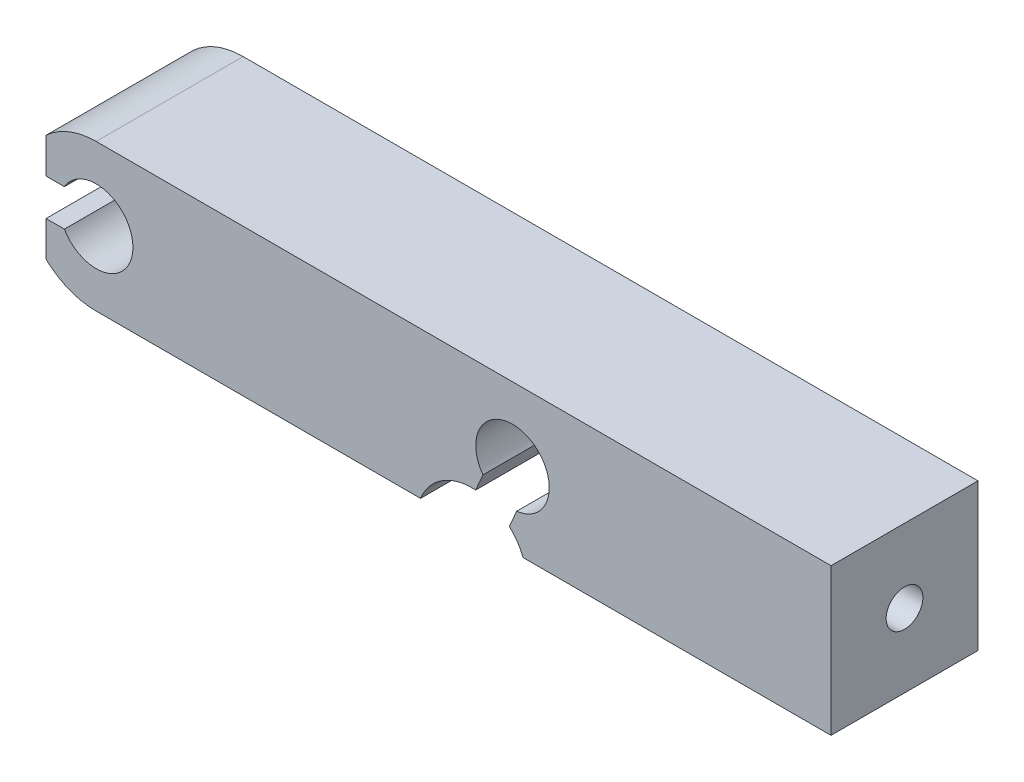
ISO-10303-21;
HEADER;
FILE_DESCRIPTION(('STEP AP214'),'2;1');
FILE_NAME('part.step','',(''),(''),'','','');
FILE_SCHEMA(('AUTOMOTIVE_DESIGN { 1 0 10303 214 1 1 1 1 }'));
ENDSEC;
DATA;
#1=APPLICATION_CONTEXT('core data for automotive mechanical design processes');
#2=APPLICATION_PROTOCOL_DEFINITION('international standard','automotive_design',2000,#1);
#3=PRODUCT_CONTEXT('',#1,'mechanical');
#4=PRODUCT('Part','Part','',(#3));
#5=PRODUCT_RELATED_PRODUCT_CATEGORY('part','',(#4));
#6=PRODUCT_DEFINITION_FORMATION('','',#4);
#7=PRODUCT_DEFINITION_CONTEXT('part definition',#1,'design');
#8=PRODUCT_DEFINITION('design','',#6,#7);
#9=PRODUCT_DEFINITION_SHAPE('','',#8);
#10=(LENGTH_UNIT() NAMED_UNIT(*) SI_UNIT(.MILLI.,.METRE.));
#11=(NAMED_UNIT(*) PLANE_ANGLE_UNIT() SI_UNIT($,.RADIAN.));
#12=(NAMED_UNIT(*) SI_UNIT($,.STERADIAN.) SOLID_ANGLE_UNIT());
#13=UNCERTAINTY_MEASURE_WITH_UNIT(LENGTH_MEASURE(1.E-05),#10,'distance_accuracy_value','');
#14=(GEOMETRIC_REPRESENTATION_CONTEXT(3) GLOBAL_UNCERTAINTY_ASSIGNED_CONTEXT((#13)) GLOBAL_UNIT_ASSIGNED_CONTEXT((#10,
#11,#12)) REPRESENTATION_CONTEXT('',''));
#15=CARTESIAN_POINT('',(0.,0.,0.));
#16=DIRECTION('',(0.,0.,1.));
#17=DIRECTION('',(1.,0.,0.));
#18=AXIS2_PLACEMENT_3D('',#15,#16,#17);
#19=CARTESIAN_POINT('',(0.,0.,4.));
#20=DIRECTION('',(0.,0.,-1.));
#21=DIRECTION('',(-1.,0.,0.));
#22=AXIS2_PLACEMENT_3D('',#19,#20,#21);
#23=CYLINDRICAL_SURFACE('',#22,2.);
#24=DIRECTION('',(0.,0.,1.));
#25=VECTOR('',#24,1.);
#26=CARTESIAN_POINT('',(-1.36602540378444,-1.46081299152751,1.));
#27=LINE('',#26,#25);
#28=CARTESIAN_POINT('',(-1.36602540378444,-1.46081299152751,0.));
#29=VERTEX_POINT('',#28);
#30=CARTESIAN_POINT('',(-1.36602540378444,-1.46081299152751,4.));
#31=VERTEX_POINT('',#30);
#32=EDGE_CURVE('E60',#29,#31,#27,.T.);
#33=ORIENTED_EDGE('',*,*,#32,.F.);
#34=CARTESIAN_POINT('',(0.,0.,0.));
#35=DIRECTION('',(0.,0.,1.));
#36=DIRECTION('',(1.,0.,0.));
#37=AXIS2_PLACEMENT_3D('',#34,#35,#36);
#38=CIRCLE('',#37,2.);
#39=CARTESIAN_POINT('',(0.,-2.,0.));
#40=VERTEX_POINT('',#39);
#41=EDGE_CURVE('E261',#29,#40,#38,.T.);
#42=ORIENTED_EDGE('',*,*,#41,.T.);
#43=DIRECTION('',(0.,0.,-1.));
#44=VECTOR('',#43,1.);
#45=CARTESIAN_POINT('',(0.,-2.,4.));
#46=LINE('',#45,#44);
#47=CARTESIAN_POINT('',(0.,-2.,4.));
#48=VERTEX_POINT('',#47);
#49=EDGE_CURVE('E273',#48,#40,#46,.T.);
#50=ORIENTED_EDGE('',*,*,#49,.F.);
#51=CARTESIAN_POINT('',(0.,0.,4.));
#52=DIRECTION('',(0.,0.,1.));
#53=DIRECTION('',(1.,0.,0.));
#54=AXIS2_PLACEMENT_3D('',#51,#52,#53);
#55=CIRCLE('',#54,2.);
#56=EDGE_CURVE('E247',#31,#48,#55,.T.);
#57=ORIENTED_EDGE('',*,*,#56,.F.);
#58=EDGE_LOOP('',(#33,#42,#50,#57));
#59=FACE_BOUND('',#58,.T.);
#60=ADVANCED_FACE('F37',(#59),#23,.T.);
#61=CARTESIAN_POINT('',(0.,2.,4.));
#62=DIRECTION('',(0.,-1.,0.));
#63=DIRECTION('',(0.,0.,-1.));
#64=AXIS2_PLACEMENT_3D('',#61,#62,#63);
#65=PLANE('',#64);
#66=DIRECTION('',(-1.,0.,0.));
#67=VECTOR('',#66,1.);
#68=CARTESIAN_POINT('',(0.,2.,0.));
#69=LINE('',#68,#67);
#70=CARTESIAN_POINT('',(20.,2.,0.));
#71=VERTEX_POINT('',#70);
#72=CARTESIAN_POINT('',(0.,2.,0.));
#73=VERTEX_POINT('',#72);
#74=EDGE_CURVE('E241',#71,#73,#69,.T.);
#75=ORIENTED_EDGE('',*,*,#74,.T.);
#76=DIRECTION('',(0.,0.,-1.));
#77=VECTOR('',#76,1.);
#78=CARTESIAN_POINT('',(0.,2.,4.));
#79=LINE('',#78,#77);
#80=CARTESIAN_POINT('',(0.,2.,4.));
#81=VERTEX_POINT('',#80);
#82=EDGE_CURVE('E45',#81,#73,#79,.T.);
#83=ORIENTED_EDGE('',*,*,#82,.F.);
#84=DIRECTION('',(-1.,0.,0.));
#85=VECTOR('',#84,1.);
#86=CARTESIAN_POINT('',(0.,2.,4.));
#87=LINE('',#86,#85);
#88=CARTESIAN_POINT('',(20.,2.,4.));
#89=VERTEX_POINT('',#88);
#90=EDGE_CURVE('E244',#89,#81,#87,.T.);
#91=ORIENTED_EDGE('',*,*,#90,.F.);
#92=DIRECTION('',(0.,0.,-1.));
#93=VECTOR('',#92,1.);
#94=CARTESIAN_POINT('',(20.,2.,4.));
#95=LINE('',#94,#93);
#96=EDGE_CURVE('E258',#89,#71,#95,.T.);
#97=ORIENTED_EDGE('',*,*,#96,.T.);
#98=EDGE_LOOP('',(#75,#83,#91,#97));
#99=FACE_BOUND('',#98,.T.);
#100=ADVANCED_FACE('F39',(#99),#65,.F.);
#101=CARTESIAN_POINT('',(-1.36602540378444,1.46081299152751,0.));
#102=VERTEX_POINT('',#101);
#103=EDGE_CURVE('E262',#73,#102,#38,.T.);
#104=ORIENTED_EDGE('',*,*,#103,.T.);
#105=DIRECTION('',(0.,0.,1.));
#106=VECTOR('',#105,1.);
#107=CARTESIAN_POINT('',(-1.36602540378444,1.46081299152751,1.));
#108=LINE('',#107,#106);
#109=CARTESIAN_POINT('',(-1.36602540378444,1.46081299152751,4.));
#110=VERTEX_POINT('',#109);
#111=EDGE_CURVE('E225',#102,#110,#108,.T.);
#112=ORIENTED_EDGE('',*,*,#111,.T.);
#113=EDGE_CURVE('E249',#81,#110,#55,.T.);
#114=ORIENTED_EDGE('',*,*,#113,.F.);
#115=ORIENTED_EDGE('',*,*,#82,.T.);
#116=EDGE_LOOP('',(#104,#112,#114,#115));
#117=FACE_BOUND('',#116,.T.);
#118=ADVANCED_FACE('F278',(#117),#23,.T.);
#119=CARTESIAN_POINT('',(0.,-2.,4.));
#120=DIRECTION('',(0.,-1.,0.));
#121=DIRECTION('',(0.,0.,-1.));
#122=AXIS2_PLACEMENT_3D('',#119,#120,#121);
#123=PLANE('',#122);
#124=DIRECTION('',(0.,0.,1.));
#125=VECTOR('',#124,1.);
#126=CARTESIAN_POINT('',(11.6190832105267,-2.,1.));
#127=LINE('',#126,#125);
#128=CARTESIAN_POINT('',(11.6190832105267,-2.,1.));
#129=VERTEX_POINT('',#128);
#130=CARTESIAN_POINT('',(11.6190832105267,-2.,4.));
#131=VERTEX_POINT('',#130);
#132=EDGE_CURVE('E195',#129,#131,#127,.T.);
#133=ORIENTED_EDGE('',*,*,#132,.F.);
#134=DIRECTION('',(1.,0.,0.));
#135=VECTOR('',#134,1.);
#136=CARTESIAN_POINT('',(9.91748930079195,-2.,1.));
#137=LINE('',#136,#135);
#138=CARTESIAN_POINT('',(8.82827307928189,-2.,1.));
#139=VERTEX_POINT('',#138);
#140=EDGE_CURVE('E178',#139,#129,#137,.T.);
#141=ORIENTED_EDGE('',*,*,#140,.F.);
#142=DIRECTION('',(0.,0.,1.));
#143=VECTOR('',#142,1.);
#144=CARTESIAN_POINT('',(8.82827307928189,-2.,1.));
#145=LINE('',#144,#143);
#146=CARTESIAN_POINT('',(8.82827307928189,-2.,4.));
#147=VERTEX_POINT('',#146);
#148=EDGE_CURVE('E197',#139,#147,#145,.T.);
#149=ORIENTED_EDGE('',*,*,#148,.T.);
#150=DIRECTION('',(-1.,0.,0.));
#151=VECTOR('',#150,1.);
#152=CARTESIAN_POINT('',(0.,-2.,4.));
#153=LINE('',#152,#151);
#154=EDGE_CURVE('E252',#147,#48,#153,.T.);
#155=ORIENTED_EDGE('',*,*,#154,.T.);
#156=ORIENTED_EDGE('',*,*,#49,.T.);
#157=DIRECTION('',(-1.,0.,0.));
#158=VECTOR('',#157,1.);
#159=CARTESIAN_POINT('',(0.,-2.,0.));
#160=LINE('',#159,#158);
#161=CARTESIAN_POINT('',(20.,-2.,0.));
#162=VERTEX_POINT('',#161);
#163=EDGE_CURVE('E265',#162,#40,#160,.T.);
#164=ORIENTED_EDGE('',*,*,#163,.F.);
#165=DIRECTION('',(0.,0.,-1.));
#166=VECTOR('',#165,1.);
#167=CARTESIAN_POINT('',(20.,-2.,4.));
#168=LINE('',#167,#166);
#169=CARTESIAN_POINT('',(20.,-2.,4.));
#170=VERTEX_POINT('',#169);
#171=EDGE_CURVE('E271',#170,#162,#168,.T.);
#172=ORIENTED_EDGE('',*,*,#171,.F.);
#173=EDGE_CURVE('E253',#170,#131,#153,.T.);
#174=ORIENTED_EDGE('',*,*,#173,.T.);
#175=EDGE_LOOP('',(#133,#141,#149,#155,#156,#164,#172,#174));
#176=FACE_BOUND('',#175,.T.);
#177=ADVANCED_FACE('F300',(#176),#123,.T.);
#178=CARTESIAN_POINT('',(20.,0.,4.));
#179=DIRECTION('',(-1.,0.,0.));
#180=DIRECTION('',(0.,0.,1.));
#181=AXIS2_PLACEMENT_3D('',#178,#179,#180);
#182=PLANE('',#181);
#183=CARTESIAN_POINT('',(20.,0.,2.00000000000477));
#184=DIRECTION('',(1.,0.,0.));
#185=DIRECTION('',(0.,0.,-1.));
#186=AXIS2_PLACEMENT_3D('',#183,#184,#185);
#187=CIRCLE('',#186,0.5);
#188=CARTESIAN_POINT('',(20.,0.,1.50000000000477));
#189=VERTEX_POINT('',#188);
#190=EDGE_CURVE('E228',#189,#189,#187,.T.);
#191=ORIENTED_EDGE('',*,*,#190,.F.);
#192=EDGE_LOOP('',(#191));
#193=FACE_BOUND('',#192,.T.);
#194=DIRECTION('',(0.,1.,0.));
#195=VECTOR('',#194,1.);
#196=CARTESIAN_POINT('',(20.,0.,0.));
#197=LINE('',#196,#195);
#198=EDGE_CURVE('E248',#162,#71,#197,.T.);
#199=ORIENTED_EDGE('',*,*,#198,.T.);
#200=ORIENTED_EDGE('',*,*,#96,.F.);
#201=DIRECTION('',(0.,1.,0.));
#202=VECTOR('',#201,1.);
#203=CARTESIAN_POINT('',(20.,0.,4.));
#204=LINE('',#203,#202);
#205=EDGE_CURVE('E256',#170,#89,#204,.T.);
#206=ORIENTED_EDGE('',*,*,#205,.F.);
#207=ORIENTED_EDGE('',*,*,#171,.T.);
#208=EDGE_LOOP('',(#199,#200,#206,#207));
#209=FACE_BOUND('',#208,.T.);
#210=ADVANCED_FACE('F297',(#193,#209),#182,.F.);
#211=CARTESIAN_POINT('',(0.,0.,4.));
#212=DIRECTION('',(0.,0.,1.));
#213=DIRECTION('',(1.,0.,0.));
#214=AXIS2_PLACEMENT_3D('',#211,#212,#213);
#215=PLANE('',#214);
#216=CARTESIAN_POINT('',(10.2236781449043,-2.55031327699351,4.));
#217=DIRECTION('',(0.,0.,1.));
#218=DIRECTION('',(1.,0.,0.));
#219=AXIS2_PLACEMENT_3D('',#216,#217,#218);
#220=CIRCLE('',#219,1.5);
#221=CARTESIAN_POINT('',(11.2454634200098,-1.45215352013772,4.));
#222=VERTEX_POINT('',#221);
#223=EDGE_CURVE('E174',#131,#222,#220,.T.);
#224=ORIENTED_EDGE('',*,*,#223,.F.);
#225=ORIENTED_EDGE('',*,*,#173,.F.);
#226=ORIENTED_EDGE('',*,*,#205,.T.);
#227=ORIENTED_EDGE('',*,*,#90,.T.);
#228=ORIENTED_EDGE('',*,*,#113,.T.);
#229=DIRECTION('',(0.,1.,0.));
#230=VECTOR('',#229,1.);
#231=CARTESIAN_POINT('',(-1.36602540378444,0.,4.));
#232=LINE('',#231,#230);
#233=CARTESIAN_POINT('',(-1.36602540378444,0.5,4.));
#234=VERTEX_POINT('',#233);
#235=EDGE_CURVE('E208',#234,#110,#232,.T.);
#236=ORIENTED_EDGE('',*,*,#235,.F.);
#237=DIRECTION('',(-1.,0.,0.));
#238=VECTOR('',#237,1.);
#239=CARTESIAN_POINT('',(0.,0.5,4.));
#240=LINE('',#239,#238);
#241=CARTESIAN_POINT('',(-0.866025403784438,0.5,4.));
#242=VERTEX_POINT('',#241);
#243=EDGE_CURVE('E221',#242,#234,#240,.T.);
#244=ORIENTED_EDGE('',*,*,#243,.F.);
#245=CARTESIAN_POINT('',(0.,0.,4.));
#246=DIRECTION('',(0.,0.,1.));
#247=DIRECTION('',(1.,0.,0.));
#248=AXIS2_PLACEMENT_3D('',#245,#246,#247);
#249=CIRCLE('',#248,1.);
#250=CARTESIAN_POINT('',(-0.866025403784438,-0.5,4.));
#251=VERTEX_POINT('',#250);
#252=EDGE_CURVE('E218',#251,#242,#249,.T.);
#253=ORIENTED_EDGE('',*,*,#252,.F.);
#254=DIRECTION('',(-1.,0.,0.));
#255=VECTOR('',#254,1.);
#256=CARTESIAN_POINT('',(0.,-0.5,4.));
#257=LINE('',#256,#255);
#258=CARTESIAN_POINT('',(-1.36602540378444,-0.5,4.));
#259=VERTEX_POINT('',#258);
#260=EDGE_CURVE('E215',#251,#259,#257,.T.);
#261=ORIENTED_EDGE('',*,*,#260,.T.);
#262=DIRECTION('',(0.,-1.,0.));
#263=VECTOR('',#262,1.);
#264=CARTESIAN_POINT('',(-1.36602540378444,0.,4.));
#265=LINE('',#264,#263);
#266=EDGE_CURVE('E203',#259,#31,#265,.T.);
#267=ORIENTED_EDGE('',*,*,#266,.T.);
#268=ORIENTED_EDGE('',*,*,#56,.T.);
#269=ORIENTED_EDGE('',*,*,#154,.F.);
#270=CARTESIAN_POINT('',(10.2236781449043,-2.55031327699351,4.));
#271=DIRECTION('',(0.,0.,1.));
#272=DIRECTION('',(1.,0.,0.));
#273=AXIS2_PLACEMENT_3D('',#270,#271,#272);
#274=CIRCLE('',#273,1.5);
#275=CARTESIAN_POINT('',(10.3281633936318,-1.0539567577113,4.));
#276=VERTEX_POINT('',#275);
#277=EDGE_CURVE('E186',#276,#147,#274,.T.);
#278=ORIENTED_EDGE('',*,*,#277,.F.);
#279=DIRECTION('',(-0.398196762426417,-0.917300026378022,0.));
#280=VECTOR('',#279,1.);
#281=CARTESIAN_POINT('',(10.527261774845,-0.595306744522293,4.));
#282=LINE('',#281,#280);
#283=CARTESIAN_POINT('',(10.527261774845,-0.595306744522293,4.));
#284=VERTEX_POINT('',#283);
#285=EDGE_CURVE('E184',#284,#276,#282,.T.);
#286=ORIENTED_EDGE('',*,*,#285,.F.);
#287=CARTESIAN_POINT('',(11.3307603,0.,4.));
#288=DIRECTION('',(0.,0.,1.));
#289=DIRECTION('',(1.,0.,0.));
#290=AXIS2_PLACEMENT_3D('',#287,#288,#289);
#291=CIRCLE('',#290,1.);
#292=CARTESIAN_POINT('',(11.444561801223,-0.993503506948711,4.));
#293=VERTEX_POINT('',#292);
#294=EDGE_CURVE('E52',#293,#284,#291,.T.);
#295=ORIENTED_EDGE('',*,*,#294,.F.);
#296=DIRECTION('',(0.398196762426413,0.917300026378024,0.));
#297=VECTOR('',#296,1.);
#298=CARTESIAN_POINT('',(11.444561801223,-0.993503506948711,4.));
#299=LINE('',#298,#297);
#300=EDGE_CURVE('E171',#222,#293,#299,.T.);
#301=ORIENTED_EDGE('',*,*,#300,.F.);
#302=EDGE_LOOP('',(#224,#225,#226,#227,#228,#236,#244,#253,#261,#267,#268,#269,#278,#286,#295,#301));
#303=FACE_BOUND('',#302,.T.);
#304=ADVANCED_FACE('F292',(#303),#215,.T.);
#305=CARTESIAN_POINT('',(0.,0.,0.));
#306=DIRECTION('',(0.,0.,1.));
#307=DIRECTION('',(1.,0.,0.));
#308=AXIS2_PLACEMENT_3D('',#305,#306,#307);
#309=PLANE('',#308);
#310=ORIENTED_EDGE('',*,*,#41,.F.);
#311=DIRECTION('',(0.,1.,0.));
#312=VECTOR('',#311,1.);
#313=CARTESIAN_POINT('',(-1.36602540378444,0.,0.));
#314=LINE('',#313,#312);
#315=EDGE_CURVE('E192',#29,#102,#314,.T.);
#316=ORIENTED_EDGE('',*,*,#315,.T.);
#317=ORIENTED_EDGE('',*,*,#103,.F.);
#318=ORIENTED_EDGE('',*,*,#74,.F.);
#319=ORIENTED_EDGE('',*,*,#198,.F.);
#320=ORIENTED_EDGE('',*,*,#163,.T.);
#321=EDGE_LOOP('',(#310,#316,#317,#318,#319,#320));
#322=FACE_BOUND('',#321,.T.);
#323=ADVANCED_FACE('F286',(#322),#309,.F.);
#324=CARTESIAN_POINT('',(13.,0.,2.00000000000477));
#325=DIRECTION('',(1.,0.,0.));
#326=DIRECTION('',(0.,0.,-1.));
#327=AXIS2_PLACEMENT_3D('',#324,#325,#326);
#328=CYLINDRICAL_SURFACE('',#327,0.5);
#329=CARTESIAN_POINT('',(13.,0.,2.00000000000477));
#330=DIRECTION('',(1.,0.,0.));
#331=DIRECTION('',(0.,0.,-1.));
#332=AXIS2_PLACEMENT_3D('',#329,#330,#331);
#333=CIRCLE('',#332,0.5);
#334=CARTESIAN_POINT('',(13.,0.,1.50000000000477));
#335=VERTEX_POINT('',#334);
#336=EDGE_CURVE('E238',#335,#335,#333,.T.);
#337=ORIENTED_EDGE('',*,*,#336,.F.);
#338=EDGE_LOOP('',(#337));
#339=FACE_BOUND('',#338,.T.);
#340=ORIENTED_EDGE('',*,*,#190,.T.);
#341=EDGE_LOOP('',(#340));
#342=FACE_BOUND('',#341,.T.);
#343=ADVANCED_FACE('F348',(#339,#342),#328,.F.);
#344=CARTESIAN_POINT('',(13.,0.,2.00000000000477));
#345=DIRECTION('',(1.,0.,0.));
#346=DIRECTION('',(0.,0.,-1.));
#347=AXIS2_PLACEMENT_3D('',#344,#345,#346);
#348=PLANE('',#347);
#349=ORIENTED_EDGE('',*,*,#336,.T.);
#350=EDGE_LOOP('',(#349));
#351=FACE_BOUND('',#350,.T.);
#352=ADVANCED_FACE('F329',(#351),#348,.T.);
#353=CARTESIAN_POINT('',(-1.36602540378444,0.,1.));
#354=DIRECTION('',(1.,0.,0.));
#355=DIRECTION('',(0.,0.,-1.));
#356=AXIS2_PLACEMENT_3D('',#353,#354,#355);
#357=PLANE('',#356);
#358=ORIENTED_EDGE('',*,*,#235,.T.);
#359=ORIENTED_EDGE('',*,*,#111,.F.);
#360=ORIENTED_EDGE('',*,*,#315,.F.);
#361=ORIENTED_EDGE('',*,*,#32,.T.);
#362=ORIENTED_EDGE('',*,*,#266,.F.);
#363=DIRECTION('',(0.,0.,1.));
#364=VECTOR('',#363,1.);
#365=CARTESIAN_POINT('',(-1.36602540378444,-0.5,1.));
#366=LINE('',#365,#364);
#367=CARTESIAN_POINT('',(-1.36602540378444,-0.5,1.));
#368=VERTEX_POINT('',#367);
#369=EDGE_CURVE('E235',#368,#259,#366,.T.);
#370=ORIENTED_EDGE('',*,*,#369,.F.);
#371=DIRECTION('',(0.,1.,0.));
#372=VECTOR('',#371,1.);
#373=CARTESIAN_POINT('',(-1.36602540378444,0.,1.));
#374=LINE('',#373,#372);
#375=CARTESIAN_POINT('',(-1.36602540378444,0.5,1.));
#376=VERTEX_POINT('',#375);
#377=EDGE_CURVE('E12',#368,#376,#374,.T.);
#378=ORIENTED_EDGE('',*,*,#377,.T.);
#379=DIRECTION('',(0.,0.,1.));
#380=VECTOR('',#379,1.);
#381=CARTESIAN_POINT('',(-1.36602540378444,0.5,1.));
#382=LINE('',#381,#380);
#383=EDGE_CURVE('E229',#376,#234,#382,.T.);
#384=ORIENTED_EDGE('',*,*,#383,.T.);
#385=EDGE_LOOP('',(#358,#359,#360,#361,#362,#370,#378,#384));
#386=FACE_BOUND('',#385,.T.);
#387=ADVANCED_FACE('F288',(#386),#357,.F.);
#388=CARTESIAN_POINT('',(0.,0.5,1.));
#389=DIRECTION('',(0.,1.,0.));
#390=DIRECTION('',(-1.,0.,0.));
#391=AXIS2_PLACEMENT_3D('',#388,#389,#390);
#392=PLANE('',#391);
#393=ORIENTED_EDGE('',*,*,#243,.T.);
#394=ORIENTED_EDGE('',*,*,#383,.F.);
#395=DIRECTION('',(-1.,0.,0.));
#396=VECTOR('',#395,1.);
#397=CARTESIAN_POINT('',(0.,0.5,1.));
#398=LINE('',#397,#396);
#399=CARTESIAN_POINT('',(-0.866025403784438,0.5,1.));
#400=VERTEX_POINT('',#399);
#401=EDGE_CURVE('E211',#400,#376,#398,.T.);
#402=ORIENTED_EDGE('',*,*,#401,.F.);
#403=DIRECTION('',(0.,0.,1.));
#404=VECTOR('',#403,1.);
#405=CARTESIAN_POINT('',(-0.866025403784438,0.5,1.));
#406=LINE('',#405,#404);
#407=EDGE_CURVE('E231',#400,#242,#406,.T.);
#408=ORIENTED_EDGE('',*,*,#407,.T.);
#409=EDGE_LOOP('',(#393,#394,#402,#408));
#410=FACE_BOUND('',#409,.T.);
#411=ADVANCED_FACE('F321',(#410),#392,.F.);
#412=CARTESIAN_POINT('',(0.,0.,1.));
#413=DIRECTION('',(0.,0.,1.));
#414=DIRECTION('',(1.,0.,0.));
#415=AXIS2_PLACEMENT_3D('',#412,#413,#414);
#416=CYLINDRICAL_SURFACE('',#415,1.);
#417=ORIENTED_EDGE('',*,*,#252,.T.);
#418=ORIENTED_EDGE('',*,*,#407,.F.);
#419=CARTESIAN_POINT('',(0.,0.,1.));
#420=DIRECTION('',(0.,0.,1.));
#421=DIRECTION('',(1.,0.,0.));
#422=AXIS2_PLACEMENT_3D('',#419,#420,#421);
#423=CIRCLE('',#422,1.);
#424=CARTESIAN_POINT('',(-0.866025403784438,-0.5,1.));
#425=VERTEX_POINT('',#424);
#426=EDGE_CURVE('E207',#425,#400,#423,.T.);
#427=ORIENTED_EDGE('',*,*,#426,.F.);
#428=DIRECTION('',(0.,0.,1.));
#429=VECTOR('',#428,1.);
#430=CARTESIAN_POINT('',(-0.866025403784438,-0.5,1.));
#431=LINE('',#430,#429);
#432=EDGE_CURVE('E233',#425,#251,#431,.T.);
#433=ORIENTED_EDGE('',*,*,#432,.T.);
#434=EDGE_LOOP('',(#417,#418,#427,#433));
#435=FACE_BOUND('',#434,.T.);
#436=ADVANCED_FACE('F318',(#435),#416,.F.);
#437=CARTESIAN_POINT('',(0.,-0.5,1.));
#438=DIRECTION('',(0.,1.,0.));
#439=DIRECTION('',(-1.,0.,0.));
#440=AXIS2_PLACEMENT_3D('',#437,#438,#439);
#441=PLANE('',#440);
#442=ORIENTED_EDGE('',*,*,#260,.F.);
#443=ORIENTED_EDGE('',*,*,#432,.F.);
#444=DIRECTION('',(-1.,0.,0.));
#445=VECTOR('',#444,1.);
#446=CARTESIAN_POINT('',(0.,-0.5,1.));
#447=LINE('',#446,#445);
#448=EDGE_CURVE('E204',#425,#368,#447,.T.);
#449=ORIENTED_EDGE('',*,*,#448,.T.);
#450=ORIENTED_EDGE('',*,*,#369,.T.);
#451=EDGE_LOOP('',(#442,#443,#449,#450));
#452=FACE_BOUND('',#451,.T.);
#453=ADVANCED_FACE('F312',(#452),#441,.T.);
#454=CARTESIAN_POINT('',(0.,0.,1.));
#455=DIRECTION('',(0.,0.,1.));
#456=DIRECTION('',(1.,0.,0.));
#457=AXIS2_PLACEMENT_3D('',#454,#455,#456);
#458=PLANE('',#457);
#459=ORIENTED_EDGE('',*,*,#377,.F.);
#460=ORIENTED_EDGE('',*,*,#448,.F.);
#461=ORIENTED_EDGE('',*,*,#426,.T.);
#462=ORIENTED_EDGE('',*,*,#401,.T.);
#463=EDGE_LOOP('',(#459,#460,#461,#462));
#464=FACE_BOUND('',#463,.T.);
#465=ADVANCED_FACE('F316',(#464),#458,.T.);
#466=CARTESIAN_POINT('',(11.3307603,0.,1.));
#467=DIRECTION('',(0.,0.,1.));
#468=DIRECTION('',(1.,0.,0.));
#469=AXIS2_PLACEMENT_3D('',#466,#467,#468);
#470=CYLINDRICAL_SURFACE('',#469,1.);
#471=ORIENTED_EDGE('',*,*,#294,.T.);
#472=DIRECTION('',(0.,0.,1.));
#473=VECTOR('',#472,1.);
#474=CARTESIAN_POINT('',(10.527261774845,-0.595306744522293,1.));
#475=LINE('',#474,#473);
#476=CARTESIAN_POINT('',(10.527261774845,-0.595306744522293,1.));
#477=VERTEX_POINT('',#476);
#478=EDGE_CURVE('E148',#477,#284,#475,.T.);
#479=ORIENTED_EDGE('',*,*,#478,.F.);
#480=CARTESIAN_POINT('',(11.3307603,0.,1.));
#481=DIRECTION('',(0.,0.,1.));
#482=DIRECTION('',(1.,0.,0.));
#483=AXIS2_PLACEMENT_3D('',#480,#481,#482);
#484=CIRCLE('',#483,1.);
#485=CARTESIAN_POINT('',(11.444561801223,-0.993503506948711,1.));
#486=VERTEX_POINT('',#485);
#487=EDGE_CURVE('E152',#486,#477,#484,.T.);
#488=ORIENTED_EDGE('',*,*,#487,.F.);
#489=DIRECTION('',(0.,0.,1.));
#490=VECTOR('',#489,1.);
#491=CARTESIAN_POINT('',(11.444561801223,-0.993503506948711,1.));
#492=LINE('',#491,#490);
#493=EDGE_CURVE('E190',#486,#293,#492,.T.);
#494=ORIENTED_EDGE('',*,*,#493,.T.);
#495=EDGE_LOOP('',(#471,#479,#488,#494));
#496=FACE_BOUND('',#495,.T.);
#497=ADVANCED_FACE('F150',(#496),#470,.F.);
#498=CARTESIAN_POINT('',(11.444561801223,-0.993503506948711,1.));
#499=DIRECTION('',(0.917300026378024,-0.398196762426413,0.));
#500=DIRECTION('',(0.398196762426413,0.917300026378024,0.));
#501=AXIS2_PLACEMENT_3D('',#498,#499,#500);
#502=PLANE('',#501);
#503=ORIENTED_EDGE('',*,*,#300,.T.);
#504=ORIENTED_EDGE('',*,*,#493,.F.);
#505=DIRECTION('',(0.398196762426413,0.917300026378024,0.));
#506=VECTOR('',#505,1.);
#507=CARTESIAN_POINT('',(11.444561801223,-0.993503506948711,1.));
#508=LINE('',#507,#506);
#509=CARTESIAN_POINT('',(11.2454634200098,-1.45215352013772,1.));
#510=VERTEX_POINT('',#509);
#511=EDGE_CURVE('E158',#510,#486,#508,.T.);
#512=ORIENTED_EDGE('',*,*,#511,.F.);
#513=DIRECTION('',(0.,0.,1.));
#514=VECTOR('',#513,1.);
#515=CARTESIAN_POINT('',(11.2454634200098,-1.45215352013772,1.));
#516=LINE('',#515,#514);
#517=EDGE_CURVE('E193',#510,#222,#516,.T.);
#518=ORIENTED_EDGE('',*,*,#517,.T.);
#519=EDGE_LOOP('',(#503,#504,#512,#518));
#520=FACE_BOUND('',#519,.T.);
#521=ADVANCED_FACE('F365',(#520),#502,.F.);
#522=CARTESIAN_POINT('',(10.2236781449043,-2.55031327699351,1.));
#523=DIRECTION('',(0.,0.,1.));
#524=DIRECTION('',(1.,0.,0.));
#525=AXIS2_PLACEMENT_3D('',#522,#523,#524);
#526=CYLINDRICAL_SURFACE('',#525,1.5);
#527=ORIENTED_EDGE('',*,*,#223,.T.);
#528=ORIENTED_EDGE('',*,*,#517,.F.);
#529=CARTESIAN_POINT('',(10.2236781449043,-2.55031327699351,1.));
#530=DIRECTION('',(0.,0.,1.));
#531=DIRECTION('',(1.,0.,0.));
#532=AXIS2_PLACEMENT_3D('',#529,#530,#531);
#533=CIRCLE('',#532,1.5);
#534=EDGE_CURVE('E180',#129,#510,#533,.T.);
#535=ORIENTED_EDGE('',*,*,#534,.F.);
#536=ORIENTED_EDGE('',*,*,#132,.T.);
#537=EDGE_LOOP('',(#527,#528,#535,#536));
#538=FACE_BOUND('',#537,.T.);
#539=ADVANCED_FACE('F373',(#538),#526,.F.);
#540=CARTESIAN_POINT('',(10.2236781449043,-2.55031327699351,1.));
#541=DIRECTION('',(0.,0.,1.));
#542=DIRECTION('',(1.,0.,0.));
#543=AXIS2_PLACEMENT_3D('',#540,#541,#542);
#544=CYLINDRICAL_SURFACE('',#543,1.5);
#545=ORIENTED_EDGE('',*,*,#277,.T.);
#546=ORIENTED_EDGE('',*,*,#148,.F.);
#547=CARTESIAN_POINT('',(10.2236781449043,-2.55031327699351,1.));
#548=DIRECTION('',(0.,0.,1.));
#549=DIRECTION('',(1.,0.,0.));
#550=AXIS2_PLACEMENT_3D('',#547,#548,#549);
#551=CIRCLE('',#550,1.5);
#552=CARTESIAN_POINT('',(10.3281633936318,-1.0539567577113,1.));
#553=VERTEX_POINT('',#552);
#554=EDGE_CURVE('E166',#553,#139,#551,.T.);
#555=ORIENTED_EDGE('',*,*,#554,.F.);
#556=DIRECTION('',(0.,0.,1.));
#557=VECTOR('',#556,1.);
#558=CARTESIAN_POINT('',(10.3281633936318,-1.0539567577113,1.));
#559=LINE('',#558,#557);
#560=EDGE_CURVE('E157',#553,#276,#559,.T.);
#561=ORIENTED_EDGE('',*,*,#560,.T.);
#562=EDGE_LOOP('',(#545,#546,#555,#561));
#563=FACE_BOUND('',#562,.T.);
#564=ADVANCED_FACE('F370',(#563),#544,.F.);
#565=CARTESIAN_POINT('',(10.527261774845,-0.595306744522293,1.));
#566=DIRECTION('',(-0.917300026378022,0.398196762426417,0.));
#567=DIRECTION('',(-0.398196762426417,-0.917300026378022,0.));
#568=AXIS2_PLACEMENT_3D('',#565,#566,#567);
#569=PLANE('',#568);
#570=ORIENTED_EDGE('',*,*,#285,.T.);
#571=ORIENTED_EDGE('',*,*,#560,.F.);
#572=DIRECTION('',(-0.398196762426417,-0.917300026378022,0.));
#573=VECTOR('',#572,1.);
#574=CARTESIAN_POINT('',(10.527261774845,-0.595306744522293,1.));
#575=LINE('',#574,#573);
#576=EDGE_CURVE('E161',#477,#553,#575,.T.);
#577=ORIENTED_EDGE('',*,*,#576,.F.);
#578=ORIENTED_EDGE('',*,*,#478,.T.);
#579=EDGE_LOOP('',(#570,#571,#577,#578));
#580=FACE_BOUND('',#579,.T.);
#581=ADVANCED_FACE('F162',(#580),#569,.F.);
#582=CARTESIAN_POINT('',(11.3307603,0.,1.));
#583=DIRECTION('',(0.,0.,1.));
#584=DIRECTION('',(1.,0.,0.));
#585=AXIS2_PLACEMENT_3D('',#582,#583,#584);
#586=PLANE('',#585);
#587=ORIENTED_EDGE('',*,*,#487,.T.);
#588=ORIENTED_EDGE('',*,*,#576,.T.);
#589=ORIENTED_EDGE('',*,*,#554,.T.);
#590=ORIENTED_EDGE('',*,*,#140,.T.);
#591=ORIENTED_EDGE('',*,*,#534,.T.);
#592=ORIENTED_EDGE('',*,*,#511,.T.);
#593=EDGE_LOOP('',(#587,#588,#589,#590,#591,#592));
#594=FACE_BOUND('',#593,.T.);
#595=ADVANCED_FACE('F168',(#594),#586,.T.);
#596=CLOSED_SHELL('',(#60,#100,#118,#177,#210,#304,#323,#343,#352,#387,#411,#436,#453,#465,#497,
#521,#539,#564,#581,#595));
#597=MANIFOLD_SOLID_BREP('B2',#596);
#598=ADVANCED_BREP_SHAPE_REPRESENTATION('',(#18,#597),#14);
#599=SHAPE_DEFINITION_REPRESENTATION(#9,#598);
ENDSEC;
END-ISO-10303-21;
